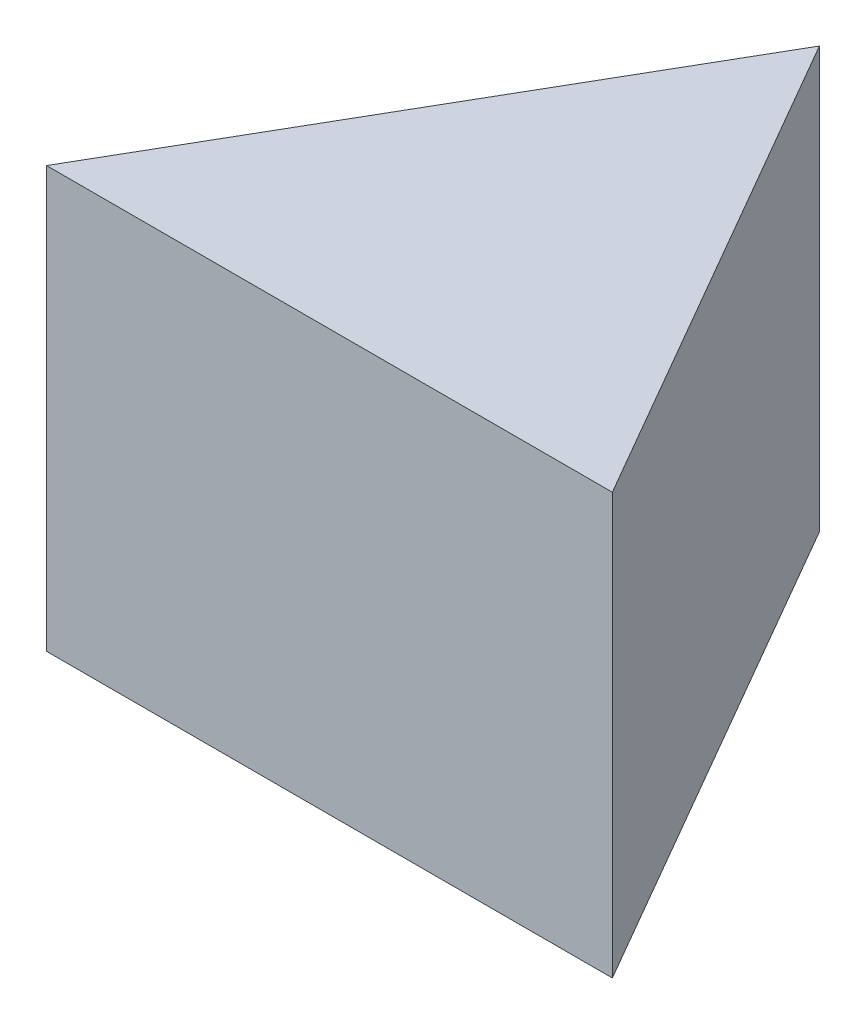
ISO-10303-21;
HEADER;
FILE_DESCRIPTION(('STEP AP214'),'2;1');
FILE_NAME('part.step','',(''),(''),'','','');
FILE_SCHEMA(('AUTOMOTIVE_DESIGN { 1 0 10303 214 1 1 1 1 }'));
ENDSEC;
DATA;
#1=APPLICATION_CONTEXT('core data for automotive mechanical design processes');
#2=APPLICATION_PROTOCOL_DEFINITION('international standard','automotive_design',2000,#1);
#3=PRODUCT_CONTEXT('',#1,'mechanical');
#4=PRODUCT('Part','Part','',(#3));
#5=PRODUCT_RELATED_PRODUCT_CATEGORY('part','',(#4));
#6=PRODUCT_DEFINITION_FORMATION('','',#4);
#7=PRODUCT_DEFINITION_CONTEXT('part definition',#1,'design');
#8=PRODUCT_DEFINITION('design','',#6,#7);
#9=PRODUCT_DEFINITION_SHAPE('','',#8);
#10=(LENGTH_UNIT() NAMED_UNIT(*) SI_UNIT(.MILLI.,.METRE.));
#11=(NAMED_UNIT(*) PLANE_ANGLE_UNIT() SI_UNIT($,.RADIAN.));
#12=(NAMED_UNIT(*) SI_UNIT($,.STERADIAN.) SOLID_ANGLE_UNIT());
#13=UNCERTAINTY_MEASURE_WITH_UNIT(LENGTH_MEASURE(1.E-05),#10,'distance_accuracy_value','');
#14=(GEOMETRIC_REPRESENTATION_CONTEXT(3) GLOBAL_UNCERTAINTY_ASSIGNED_CONTEXT((#13)) GLOBAL_UNIT_ASSIGNED_CONTEXT((#10,
#11,#12)) REPRESENTATION_CONTEXT('',''));
#15=CARTESIAN_POINT('',(0.,0.,0.));
#16=DIRECTION('',(0.,0.,1.));
#17=DIRECTION('',(1.,0.,0.));
#18=AXIS2_PLACEMENT_3D('',#15,#16,#17);
#19=CARTESIAN_POINT('',(19.5,29.,-33.7749907475931));
#20=DIRECTION('',(0.866025403784438,0.,0.5));
#21=DIRECTION('',(0.5,0.,-0.866025403784439));
#22=AXIS2_PLACEMENT_3D('',#19,#20,#21);
#23=PLANE('',#22);
#24=DIRECTION('',(-0.5,0.,0.866025403784439));
#25=VECTOR('',#24,1.);
#26=CARTESIAN_POINT('',(19.5,0.,-33.7749907475931));
#27=LINE('',#26,#25);
#28=CARTESIAN_POINT('',(19.5,0.,-33.7749907475931));
#29=VERTEX_POINT('',#28);
#30=CARTESIAN_POINT('',(0.,0.,0.));
#31=VERTEX_POINT('',#30);
#32=EDGE_CURVE('E84',#29,#31,#27,.T.);
#33=ORIENTED_EDGE('',*,*,#32,.T.);
#34=DIRECTION('',(0.,-1.,0.));
#35=VECTOR('',#34,1.);
#36=CARTESIAN_POINT('',(0.,29.,0.));
#37=LINE('',#36,#35);
#38=CARTESIAN_POINT('',(0.,29.,0.));
#39=VERTEX_POINT('',#38);
#40=EDGE_CURVE('E11',#39,#31,#37,.T.);
#41=ORIENTED_EDGE('',*,*,#40,.F.);
#42=DIRECTION('',(-0.5,0.,0.866025403784439));
#43=VECTOR('',#42,1.);
#44=CARTESIAN_POINT('',(19.5,29.,-33.7749907475931));
#45=LINE('',#44,#43);
#46=CARTESIAN_POINT('',(19.5,29.,-33.7749907475931));
#47=VERTEX_POINT('',#46);
#48=EDGE_CURVE('E77',#47,#39,#45,.T.);
#49=ORIENTED_EDGE('',*,*,#48,.F.);
#50=DIRECTION('',(0.,-1.,0.));
#51=VECTOR('',#50,1.);
#52=CARTESIAN_POINT('',(19.5,29.,-33.7749907475931));
#53=LINE('',#52,#51);
#54=EDGE_CURVE('E85',#47,#29,#53,.T.);
#55=ORIENTED_EDGE('',*,*,#54,.T.);
#56=EDGE_LOOP('',(#33,#41,#49,#55));
#57=FACE_BOUND('',#56,.T.);
#58=ADVANCED_FACE('F37',(#57),#23,.F.);
#59=CARTESIAN_POINT('',(0.,29.,0.));
#60=DIRECTION('',(0.,0.,-1.));
#61=DIRECTION('',(-1.,0.,0.));
#62=AXIS2_PLACEMENT_3D('',#59,#60,#61);
#63=PLANE('',#62);
#64=DIRECTION('',(1.,0.,0.));
#65=VECTOR('',#64,1.);
#66=CARTESIAN_POINT('',(0.,0.,0.));
#67=LINE('',#66,#65);
#68=CARTESIAN_POINT('',(39.,0.,0.));
#69=VERTEX_POINT('',#68);
#70=EDGE_CURVE('E65',#31,#69,#67,.T.);
#71=ORIENTED_EDGE('',*,*,#70,.T.);
#72=DIRECTION('',(0.,-1.,0.));
#73=VECTOR('',#72,1.);
#74=CARTESIAN_POINT('',(39.,29.,0.));
#75=LINE('',#74,#73);
#76=CARTESIAN_POINT('',(39.,29.,0.));
#77=VERTEX_POINT('',#76);
#78=EDGE_CURVE('E45',#77,#69,#75,.T.);
#79=ORIENTED_EDGE('',*,*,#78,.F.);
#80=DIRECTION('',(1.,0.,0.));
#81=VECTOR('',#80,1.);
#82=CARTESIAN_POINT('',(0.,29.,0.));
#83=LINE('',#82,#81);
#84=EDGE_CURVE('E73',#39,#77,#83,.T.);
#85=ORIENTED_EDGE('',*,*,#84,.F.);
#86=ORIENTED_EDGE('',*,*,#40,.T.);
#87=EDGE_LOOP('',(#71,#79,#85,#86));
#88=FACE_BOUND('',#87,.T.);
#89=ADVANCED_FACE('F74',(#88),#63,.F.);
#90=CARTESIAN_POINT('',(39.,29.,0.));
#91=DIRECTION('',(-0.866025403784438,0.,0.5));
#92=DIRECTION('',(0.5,0.,0.866025403784439));
#93=AXIS2_PLACEMENT_3D('',#90,#91,#92);
#94=PLANE('',#93);
#95=DIRECTION('',(-0.5,0.,-0.866025403784439));
#96=VECTOR('',#95,1.);
#97=CARTESIAN_POINT('',(39.,0.,0.));
#98=LINE('',#97,#96);
#99=EDGE_CURVE('E70',#69,#29,#98,.T.);
#100=ORIENTED_EDGE('',*,*,#99,.T.);
#101=ORIENTED_EDGE('',*,*,#54,.F.);
#102=DIRECTION('',(-0.5,0.,-0.866025403784439));
#103=VECTOR('',#102,1.);
#104=CARTESIAN_POINT('',(39.,29.,0.));
#105=LINE('',#104,#103);
#106=EDGE_CURVE('E53',#77,#47,#105,.T.);
#107=ORIENTED_EDGE('',*,*,#106,.F.);
#108=ORIENTED_EDGE('',*,*,#78,.T.);
#109=EDGE_LOOP('',(#100,#101,#107,#108));
#110=FACE_BOUND('',#109,.T.);
#111=ADVANCED_FACE('F92',(#110),#94,.F.);
#112=CARTESIAN_POINT('',(0.,29.,0.));
#113=DIRECTION('',(0.,1.,0.));
#114=DIRECTION('',(0.,0.,1.));
#115=AXIS2_PLACEMENT_3D('',#112,#113,#114);
#116=PLANE('',#115);
#117=ORIENTED_EDGE('',*,*,#48,.T.);
#118=ORIENTED_EDGE('',*,*,#84,.T.);
#119=ORIENTED_EDGE('',*,*,#106,.T.);
#120=EDGE_LOOP('',(#117,#118,#119));
#121=FACE_BOUND('',#120,.T.);
#122=ADVANCED_FACE('F80',(#121),#116,.T.);
#123=CARTESIAN_POINT('',(0.,0.,0.));
#124=DIRECTION('',(0.,1.,0.));
#125=DIRECTION('',(0.,0.,1.));
#126=AXIS2_PLACEMENT_3D('',#123,#124,#125);
#127=PLANE('',#126);
#128=ORIENTED_EDGE('',*,*,#32,.F.);
#129=ORIENTED_EDGE('',*,*,#99,.F.);
#130=ORIENTED_EDGE('',*,*,#70,.F.);
#131=EDGE_LOOP('',(#128,#129,#130));
#132=FACE_BOUND('',#131,.T.);
#133=ADVANCED_FACE('F93',(#132),#127,.F.);
#134=CLOSED_SHELL('',(#58,#89,#111,#122,#133));
#135=MANIFOLD_SOLID_BREP('B2',#134);
#136=ADVANCED_BREP_SHAPE_REPRESENTATION('',(#18,#135),#14);
#137=SHAPE_DEFINITION_REPRESENTATION(#9,#136);
ENDSEC;
END-ISO-10303-21;
